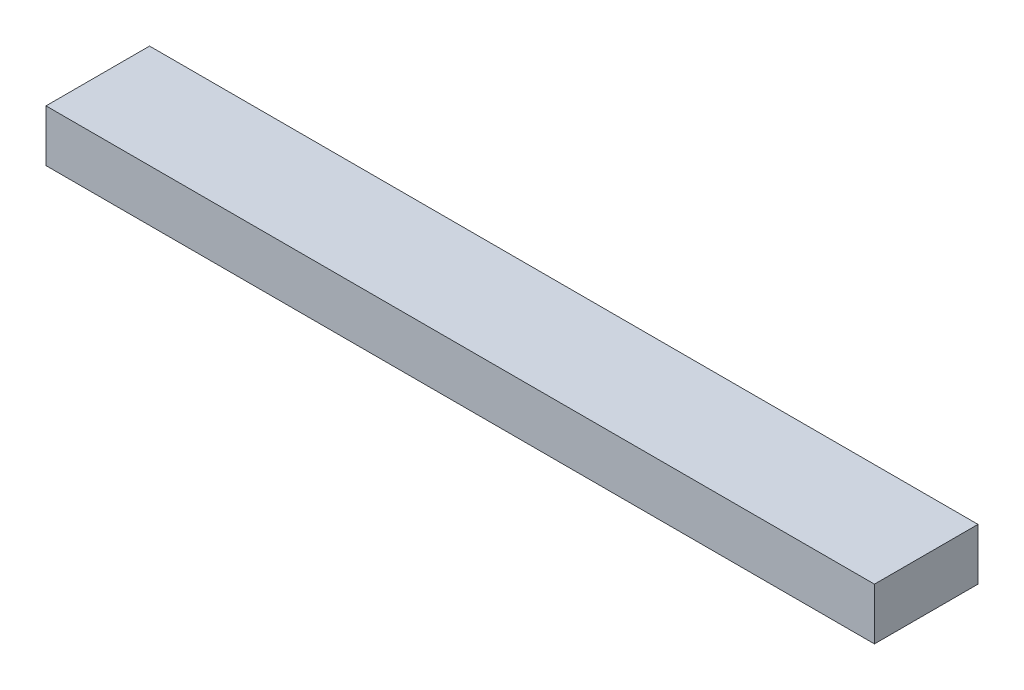
ISO-10303-21;
HEADER;
FILE_DESCRIPTION(('STEP AP214'),'2;1');
FILE_NAME('part.step','',(''),(''),'','','');
FILE_SCHEMA(('AUTOMOTIVE_DESIGN { 1 0 10303 214 1 1 1 1 }'));
ENDSEC;
DATA;
#1=APPLICATION_CONTEXT('core data for automotive mechanical design processes');
#2=APPLICATION_PROTOCOL_DEFINITION('international standard','automotive_design',2000,#1);
#3=PRODUCT_CONTEXT('',#1,'mechanical');
#4=PRODUCT('Part','Part','',(#3));
#5=PRODUCT_RELATED_PRODUCT_CATEGORY('part','',(#4));
#6=PRODUCT_DEFINITION_FORMATION('','',#4);
#7=PRODUCT_DEFINITION_CONTEXT('part definition',#1,'design');
#8=PRODUCT_DEFINITION('design','',#6,#7);
#9=PRODUCT_DEFINITION_SHAPE('','',#8);
#10=(LENGTH_UNIT() NAMED_UNIT(*) SI_UNIT(.MILLI.,.METRE.));
#11=(NAMED_UNIT(*) PLANE_ANGLE_UNIT() SI_UNIT($,.RADIAN.));
#12=(NAMED_UNIT(*) SI_UNIT($,.STERADIAN.) SOLID_ANGLE_UNIT());
#13=UNCERTAINTY_MEASURE_WITH_UNIT(LENGTH_MEASURE(1.E-05),#10,'distance_accuracy_value','');
#14=(GEOMETRIC_REPRESENTATION_CONTEXT(3) GLOBAL_UNCERTAINTY_ASSIGNED_CONTEXT((#13)) GLOBAL_UNIT_ASSIGNED_CONTEXT((#10,
#11,#12)) REPRESENTATION_CONTEXT('',''));
#15=CARTESIAN_POINT('',(0.,0.,0.));
#16=DIRECTION('',(0.,0.,1.));
#17=DIRECTION('',(1.,0.,0.));
#18=AXIS2_PLACEMENT_3D('',#15,#16,#17);
#19=CARTESIAN_POINT('',(304.8,0.,0.));
#20=DIRECTION('',(0.,0.,-1.));
#21=DIRECTION('',(-1.,0.,0.));
#22=AXIS2_PLACEMENT_3D('',#19,#20,#21);
#23=PLANE('',#22);
#24=DIRECTION('',(0.,-1.,0.));
#25=VECTOR('',#24,1.);
#26=CARTESIAN_POINT('',(0.,0.,0.));
#27=LINE('',#26,#25);
#28=CARTESIAN_POINT('',(0.,19.05,0.));
#29=VERTEX_POINT('',#28);
#30=CARTESIAN_POINT('',(0.,0.,0.));
#31=VERTEX_POINT('',#30);
#32=EDGE_CURVE('E111',#29,#31,#27,.T.);
#33=ORIENTED_EDGE('',*,*,#32,.T.);
#34=DIRECTION('',(-1.,0.,0.));
#35=VECTOR('',#34,1.);
#36=CARTESIAN_POINT('',(304.8,0.,0.));
#37=LINE('',#36,#35);
#38=CARTESIAN_POINT('',(304.8,0.,0.));
#39=VERTEX_POINT('',#38);
#40=EDGE_CURVE('E11',#39,#31,#37,.T.);
#41=ORIENTED_EDGE('',*,*,#40,.F.);
#42=DIRECTION('',(0.,-1.,0.));
#43=VECTOR('',#42,1.);
#44=CARTESIAN_POINT('',(304.8,0.,0.));
#45=LINE('',#44,#43);
#46=CARTESIAN_POINT('',(304.8,19.05,0.));
#47=VERTEX_POINT('',#46);
#48=EDGE_CURVE('E95',#47,#39,#45,.T.);
#49=ORIENTED_EDGE('',*,*,#48,.F.);
#50=DIRECTION('',(-1.,0.,0.));
#51=VECTOR('',#50,1.);
#52=CARTESIAN_POINT('',(304.8,19.05,0.));
#53=LINE('',#52,#51);
#54=EDGE_CURVE('E107',#47,#29,#53,.T.);
#55=ORIENTED_EDGE('',*,*,#54,.T.);
#56=EDGE_LOOP('',(#33,#41,#49,#55));
#57=FACE_BOUND('',#56,.T.);
#58=ADVANCED_FACE('F43',(#57),#23,.F.);
#59=CARTESIAN_POINT('',(304.8,0.,0.));
#60=DIRECTION('',(0.,1.,0.));
#61=DIRECTION('',(0.,0.,1.));
#62=AXIS2_PLACEMENT_3D('',#59,#60,#61);
#63=PLANE('',#62);
#64=DIRECTION('',(0.,0.,-1.));
#65=VECTOR('',#64,1.);
#66=CARTESIAN_POINT('',(0.,0.,0.));
#67=LINE('',#66,#65);
#68=CARTESIAN_POINT('',(0.,0.,-38.1));
#69=VERTEX_POINT('',#68);
#70=EDGE_CURVE('E100',#31,#69,#67,.T.);
#71=ORIENTED_EDGE('',*,*,#70,.T.);
#72=DIRECTION('',(-1.,0.,0.));
#73=VECTOR('',#72,1.);
#74=CARTESIAN_POINT('',(304.8,0.,-38.1));
#75=LINE('',#74,#73);
#76=CARTESIAN_POINT('',(304.8,0.,-38.1));
#77=VERTEX_POINT('',#76);
#78=EDGE_CURVE('E52',#77,#69,#75,.T.);
#79=ORIENTED_EDGE('',*,*,#78,.F.);
#80=DIRECTION('',(0.,0.,-1.));
#81=VECTOR('',#80,1.);
#82=CARTESIAN_POINT('',(304.8,0.,0.));
#83=LINE('',#82,#81);
#84=EDGE_CURVE('E90',#39,#77,#83,.T.);
#85=ORIENTED_EDGE('',*,*,#84,.F.);
#86=ORIENTED_EDGE('',*,*,#40,.T.);
#87=EDGE_LOOP('',(#71,#79,#85,#86));
#88=FACE_BOUND('',#87,.T.);
#89=ADVANCED_FACE('F99',(#88),#63,.F.);
#90=CARTESIAN_POINT('',(304.8,0.,-38.1));
#91=DIRECTION('',(0.,0.,1.));
#92=DIRECTION('',(1.,0.,0.));
#93=AXIS2_PLACEMENT_3D('',#90,#91,#92);
#94=PLANE('',#93);
#95=DIRECTION('',(0.,1.,0.));
#96=VECTOR('',#95,1.);
#97=CARTESIAN_POINT('',(0.,0.,-38.1));
#98=LINE('',#97,#96);
#99=CARTESIAN_POINT('',(0.,19.05,-38.1));
#100=VERTEX_POINT('',#99);
#101=EDGE_CURVE('E77',#69,#100,#98,.T.);
#102=ORIENTED_EDGE('',*,*,#101,.T.);
#103=DIRECTION('',(-1.,0.,0.));
#104=VECTOR('',#103,1.);
#105=CARTESIAN_POINT('',(304.8,19.05,-38.1));
#106=LINE('',#105,#104);
#107=CARTESIAN_POINT('',(304.8,19.05,-38.1));
#108=VERTEX_POINT('',#107);
#109=EDGE_CURVE('E102',#108,#100,#106,.T.);
#110=ORIENTED_EDGE('',*,*,#109,.F.);
#111=DIRECTION('',(0.,1.,0.));
#112=VECTOR('',#111,1.);
#113=CARTESIAN_POINT('',(304.8,0.,-38.1));
#114=LINE('',#113,#112);
#115=EDGE_CURVE('E93',#77,#108,#114,.T.);
#116=ORIENTED_EDGE('',*,*,#115,.F.);
#117=ORIENTED_EDGE('',*,*,#78,.T.);
#118=EDGE_LOOP('',(#102,#110,#116,#117));
#119=FACE_BOUND('',#118,.T.);
#120=ADVANCED_FACE('F103',(#119),#94,.F.);
#121=CARTESIAN_POINT('',(304.8,19.05,0.));
#122=DIRECTION('',(0.,-1.,0.));
#123=DIRECTION('',(0.,0.,-1.));
#124=AXIS2_PLACEMENT_3D('',#121,#122,#123);
#125=PLANE('',#124);
#126=DIRECTION('',(0.,0.,1.));
#127=VECTOR('',#126,1.);
#128=CARTESIAN_POINT('',(0.,19.05,0.));
#129=LINE('',#128,#127);
#130=EDGE_CURVE('E83',#100,#29,#129,.T.);
#131=ORIENTED_EDGE('',*,*,#130,.T.);
#132=ORIENTED_EDGE('',*,*,#54,.F.);
#133=DIRECTION('',(0.,0.,1.));
#134=VECTOR('',#133,1.);
#135=CARTESIAN_POINT('',(304.8,19.05,0.));
#136=LINE('',#135,#134);
#137=EDGE_CURVE('E60',#108,#47,#136,.T.);
#138=ORIENTED_EDGE('',*,*,#137,.F.);
#139=ORIENTED_EDGE('',*,*,#109,.T.);
#140=EDGE_LOOP('',(#131,#132,#138,#139));
#141=FACE_BOUND('',#140,.T.);
#142=ADVANCED_FACE('F124',(#141),#125,.F.);
#143=CARTESIAN_POINT('',(304.8,0.,0.));
#144=DIRECTION('',(-1.,0.,0.));
#145=DIRECTION('',(0.,0.,1.));
#146=AXIS2_PLACEMENT_3D('',#143,#144,#145);
#147=PLANE('',#146);
#148=ORIENTED_EDGE('',*,*,#48,.T.);
#149=ORIENTED_EDGE('',*,*,#84,.T.);
#150=ORIENTED_EDGE('',*,*,#115,.T.);
#151=ORIENTED_EDGE('',*,*,#137,.T.);
#152=EDGE_LOOP('',(#148,#149,#150,#151));
#153=FACE_BOUND('',#152,.T.);
#154=ADVANCED_FACE('F91',(#153),#147,.F.);
#155=CARTESIAN_POINT('',(0.,0.,0.));
#156=DIRECTION('',(-1.,0.,0.));
#157=DIRECTION('',(0.,0.,1.));
#158=AXIS2_PLACEMENT_3D('',#155,#156,#157);
#159=PLANE('',#158);
#160=ORIENTED_EDGE('',*,*,#32,.F.);
#161=ORIENTED_EDGE('',*,*,#130,.F.);
#162=ORIENTED_EDGE('',*,*,#101,.F.);
#163=ORIENTED_EDGE('',*,*,#70,.F.);
#164=EDGE_LOOP('',(#160,#161,#162,#163));
#165=FACE_BOUND('',#164,.T.);
#166=ADVANCED_FACE('F127',(#165),#159,.T.);
#167=CLOSED_SHELL('',(#58,#89,#120,#142,#154,#166));
#168=MANIFOLD_SOLID_BREP('B2',#167);
#169=ADVANCED_BREP_SHAPE_REPRESENTATION('',(#18,#168),#14);
#170=SHAPE_DEFINITION_REPRESENTATION(#9,#169);
ENDSEC;
END-ISO-10303-21;
